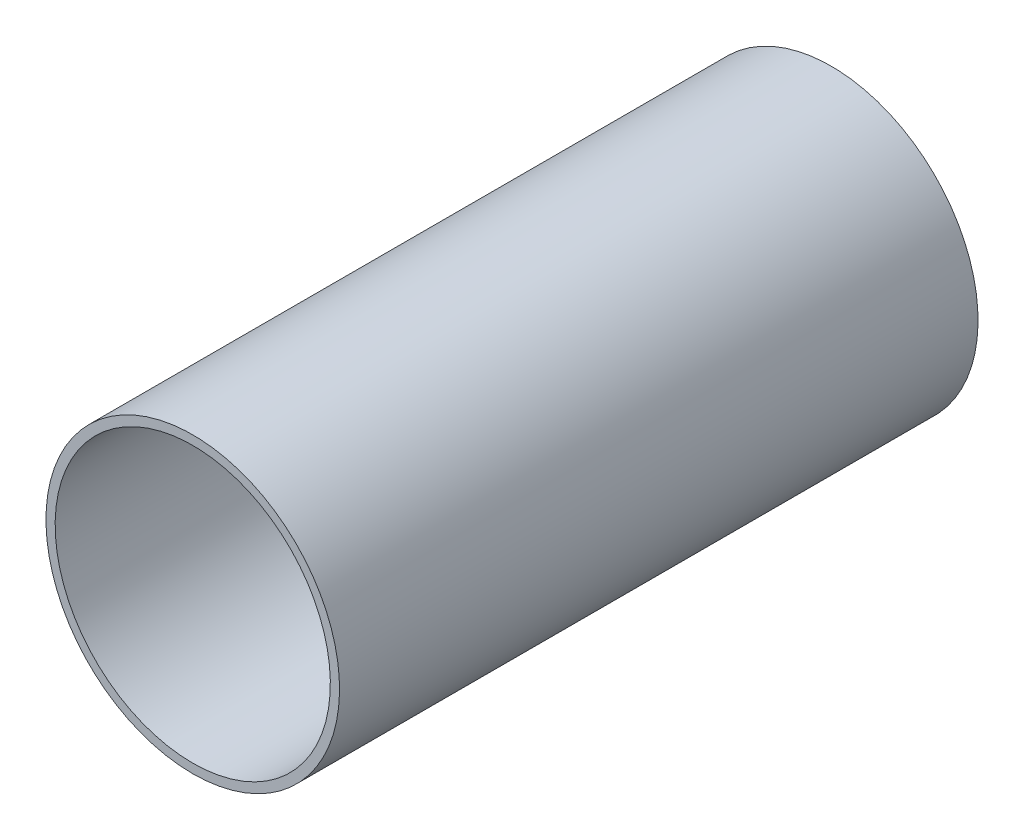
ISO-10303-21;
HEADER;
FILE_DESCRIPTION(('STEP AP214'),'2;1');
FILE_NAME('part.step','',(''),(''),'','','');
FILE_SCHEMA(('AUTOMOTIVE_DESIGN { 1 0 10303 214 1 1 1 1 }'));
ENDSEC;
DATA;
#1=APPLICATION_CONTEXT('core data for automotive mechanical design processes');
#2=APPLICATION_PROTOCOL_DEFINITION('international standard','automotive_design',2000,#1);
#3=PRODUCT_CONTEXT('',#1,'mechanical');
#4=PRODUCT('Part','Part','',(#3));
#5=PRODUCT_RELATED_PRODUCT_CATEGORY('part','',(#4));
#6=PRODUCT_DEFINITION_FORMATION('','',#4);
#7=PRODUCT_DEFINITION_CONTEXT('part definition',#1,'design');
#8=PRODUCT_DEFINITION('design','',#6,#7);
#9=PRODUCT_DEFINITION_SHAPE('','',#8);
#10=(LENGTH_UNIT() NAMED_UNIT(*) SI_UNIT(.MILLI.,.METRE.));
#11=(NAMED_UNIT(*) PLANE_ANGLE_UNIT() SI_UNIT($,.RADIAN.));
#12=(NAMED_UNIT(*) SI_UNIT($,.STERADIAN.) SOLID_ANGLE_UNIT());
#13=UNCERTAINTY_MEASURE_WITH_UNIT(LENGTH_MEASURE(1.E-05),#10,'distance_accuracy_value','');
#14=(GEOMETRIC_REPRESENTATION_CONTEXT(3) GLOBAL_UNCERTAINTY_ASSIGNED_CONTEXT((#13)) GLOBAL_UNIT_ASSIGNED_CONTEXT((#10,
#11,#12)) REPRESENTATION_CONTEXT('',''));
#15=CARTESIAN_POINT('',(0.,0.,0.));
#16=DIRECTION('',(0.,0.,1.));
#17=DIRECTION('',(1.,0.,0.));
#18=AXIS2_PLACEMENT_3D('',#15,#16,#17);
#19=CARTESIAN_POINT('',(139.7,-80.772,-0.045));
#20=DIRECTION('',(0.,0.,-1.));
#21=DIRECTION('',(0.,-1.,0.));
#22=AXIS2_PLACEMENT_3D('',#19,#20,#21);
#23=CYLINDRICAL_SURFACE('',#22,0.375);
#24=CARTESIAN_POINT('',(139.7,-80.772,-0.035));
#25=DIRECTION('',(0.,0.,-1.));
#26=DIRECTION('',(0.,-1.,0.));
#27=AXIS2_PLACEMENT_3D('',#24,#25,#26);
#28=CIRCLE('',#27,0.375);
#29=CARTESIAN_POINT('',(139.7,-81.147,-0.035));
#30=VERTEX_POINT('',#29);
#31=EDGE_CURVE('E64',#30,#30,#28,.T.);
#32=ORIENTED_EDGE('',*,*,#31,.T.);
#33=DIRECTION('',(0.,0.,1.));
#34=VECTOR('',#33,1.);
#35=CARTESIAN_POINT('',(139.7,-81.147,-0.045));
#36=LINE('',#35,#34);
#37=CARTESIAN_POINT('',(139.7,-81.147,1.705));
#38=VERTEX_POINT('',#37);
#39=EDGE_CURVE('E11',#30,#38,#36,.T.);
#40=ORIENTED_EDGE('',*,*,#39,.T.);
#41=CARTESIAN_POINT('',(139.7,-80.772,1.705));
#42=DIRECTION('',(0.,0.,-1.));
#43=DIRECTION('',(0.,-1.,0.));
#44=AXIS2_PLACEMENT_3D('',#41,#42,#43);
#45=CIRCLE('',#44,0.375);
#46=EDGE_CURVE('E25',#38,#38,#45,.T.);
#47=ORIENTED_EDGE('',*,*,#46,.F.);
#48=ORIENTED_EDGE('',*,*,#39,.F.);
#49=EDGE_LOOP('',(#32,#40,#47,#48));
#50=FACE_BOUND('',#49,.T.);
#51=ADVANCED_FACE('F17',(#50),#23,.F.);
#52=CARTESIAN_POINT('',(139.7,-81.172,1.705));
#53=DIRECTION('',(0.,0.,1.));
#54=DIRECTION('',(1.,0.,0.));
#55=AXIS2_PLACEMENT_3D('',#52,#53,#54);
#56=PLANE('',#55);
#57=ORIENTED_EDGE('',*,*,#46,.T.);
#58=EDGE_LOOP('',(#57));
#59=FACE_BOUND('',#58,.T.);
#60=CARTESIAN_POINT('',(139.7,-80.772,1.705));
#61=DIRECTION('',(0.,0.,1.));
#62=DIRECTION('',(0.,-1.,0.));
#63=AXIS2_PLACEMENT_3D('',#60,#61,#62);
#64=CIRCLE('',#63,0.4);
#65=CARTESIAN_POINT('',(139.7,-81.172,1.705));
#66=VERTEX_POINT('',#65);
#67=EDGE_CURVE('E56',#66,#66,#64,.T.);
#68=ORIENTED_EDGE('',*,*,#67,.T.);
#69=EDGE_LOOP('',(#68));
#70=FACE_BOUND('',#69,.T.);
#71=ADVANCED_FACE('F80',(#59,#70),#56,.T.);
#72=CARTESIAN_POINT('',(139.7,-81.172,-0.035));
#73=DIRECTION('',(0.,0.,1.));
#74=DIRECTION('',(1.,0.,0.));
#75=AXIS2_PLACEMENT_3D('',#72,#73,#74);
#76=PLANE('',#75);
#77=ORIENTED_EDGE('',*,*,#31,.F.);
#78=EDGE_LOOP('',(#77));
#79=FACE_BOUND('',#78,.T.);
#80=CARTESIAN_POINT('',(139.7,-80.772,-0.035));
#81=DIRECTION('',(0.,0.,1.));
#82=DIRECTION('',(0.,-1.,0.));
#83=AXIS2_PLACEMENT_3D('',#80,#81,#82);
#84=CIRCLE('',#83,0.4);
#85=CARTESIAN_POINT('',(139.7,-81.172,-0.035));
#86=VERTEX_POINT('',#85);
#87=EDGE_CURVE('E55',#86,#86,#84,.T.);
#88=ORIENTED_EDGE('',*,*,#87,.F.);
#89=EDGE_LOOP('',(#88));
#90=FACE_BOUND('',#89,.T.);
#91=ADVANCED_FACE('F77',(#79,#90),#76,.F.);
#92=CARTESIAN_POINT('',(139.7,-80.772,-0.035));
#93=DIRECTION('',(0.,0.,-1.));
#94=DIRECTION('',(0.,-1.,0.));
#95=AXIS2_PLACEMENT_3D('',#92,#93,#94);
#96=CYLINDRICAL_SURFACE('',#95,0.4);
#97=ORIENTED_EDGE('',*,*,#87,.T.);
#98=DIRECTION('',(0.,0.,1.));
#99=VECTOR('',#98,1.);
#100=CARTESIAN_POINT('',(139.7,-81.172,-0.035));
#101=LINE('',#100,#99);
#102=EDGE_CURVE('E52',#86,#66,#101,.T.);
#103=ORIENTED_EDGE('',*,*,#102,.T.);
#104=ORIENTED_EDGE('',*,*,#67,.F.);
#105=ORIENTED_EDGE('',*,*,#102,.F.);
#106=EDGE_LOOP('',(#97,#103,#104,#105));
#107=FACE_BOUND('',#106,.T.);
#108=ADVANCED_FACE('F53',(#107),#96,.T.);
#109=CLOSED_SHELL('',(#51,#71,#91,#108));
#110=MANIFOLD_SOLID_BREP('B1',#109);
#111=ADVANCED_BREP_SHAPE_REPRESENTATION('',(#18,#110),#14);
#112=SHAPE_DEFINITION_REPRESENTATION(#9,#111);
ENDSEC;
END-ISO-10303-21;
